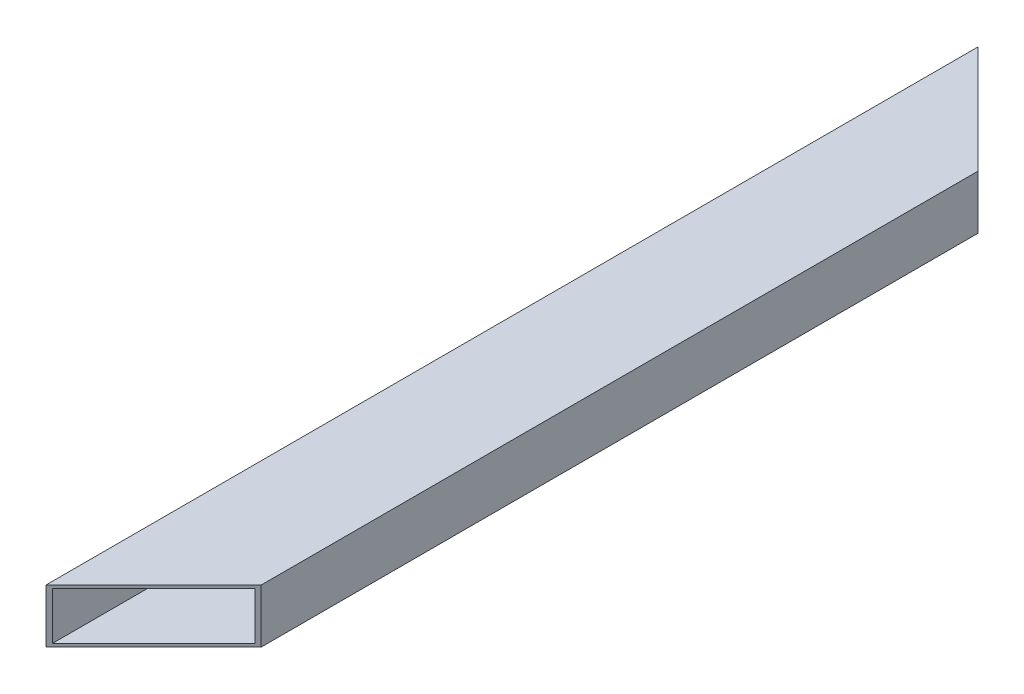
ISO-10303-21;
HEADER;
FILE_DESCRIPTION(('STEP AP214'),'2;1');
FILE_NAME('part.step','',(''),(''),'','','');
FILE_SCHEMA(('AUTOMOTIVE_DESIGN { 1 0 10303 214 1 1 1 1 }'));
ENDSEC;
DATA;
#1=APPLICATION_CONTEXT('core data for automotive mechanical design processes');
#2=APPLICATION_PROTOCOL_DEFINITION('international standard','automotive_design',2000,#1);
#3=PRODUCT_CONTEXT('',#1,'mechanical');
#4=PRODUCT('Part','Part','',(#3));
#5=PRODUCT_RELATED_PRODUCT_CATEGORY('part','',(#4));
#6=PRODUCT_DEFINITION_FORMATION('','',#4);
#7=PRODUCT_DEFINITION_CONTEXT('part definition',#1,'design');
#8=PRODUCT_DEFINITION('design','',#6,#7);
#9=PRODUCT_DEFINITION_SHAPE('','',#8);
#10=(LENGTH_UNIT() NAMED_UNIT(*) SI_UNIT(.MILLI.,.METRE.));
#11=(NAMED_UNIT(*) PLANE_ANGLE_UNIT() SI_UNIT($,.RADIAN.));
#12=(NAMED_UNIT(*) SI_UNIT($,.STERADIAN.) SOLID_ANGLE_UNIT());
#13=UNCERTAINTY_MEASURE_WITH_UNIT(LENGTH_MEASURE(1.E-05),#10,'distance_accuracy_value','');
#14=(GEOMETRIC_REPRESENTATION_CONTEXT(3) GLOBAL_UNCERTAINTY_ASSIGNED_CONTEXT((#13)) GLOBAL_UNIT_ASSIGNED_CONTEXT((#10,
#11,#12)) REPRESENTATION_CONTEXT('',''));
#15=CARTESIAN_POINT('',(0.,0.,0.));
#16=DIRECTION('',(0.,0.,1.));
#17=DIRECTION('',(1.,0.,0.));
#18=AXIS2_PLACEMENT_3D('',#15,#16,#17);
#19=CARTESIAN_POINT('',(25.4,-12.7,440.));
#20=DIRECTION('',(-1.,0.,0.));
#21=DIRECTION('',(0.,0.,1.));
#22=AXIS2_PLACEMENT_3D('',#19,#20,#21);
#23=PLANE('',#22);
#24=DIRECTION('',(0.,0.,-1.));
#25=VECTOR('',#24,1.);
#26=CARTESIAN_POINT('',(25.4,12.7,440.));
#27=LINE('',#26,#25);
#28=CARTESIAN_POINT('',(25.4,12.7,389.200000000001));
#29=VERTEX_POINT('',#28);
#30=CARTESIAN_POINT('',(25.4,12.7,50.7999999999994));
#31=VERTEX_POINT('',#30);
#32=EDGE_CURVE('E114',#29,#31,#27,.T.);
#33=ORIENTED_EDGE('',*,*,#32,.F.);
#34=DIRECTION('',(0.,1.,0.));
#35=VECTOR('',#34,1.);
#36=CARTESIAN_POINT('',(25.4,-13.3,389.200000000001));
#37=LINE('',#36,#35);
#38=CARTESIAN_POINT('',(25.4,-12.7,389.200000000001));
#39=VERTEX_POINT('',#38);
#40=EDGE_CURVE('E102',#39,#29,#37,.T.);
#41=ORIENTED_EDGE('',*,*,#40,.F.);
#42=DIRECTION('',(0.,0.,-1.));
#43=VECTOR('',#42,1.);
#44=CARTESIAN_POINT('',(25.4,-12.7,440.));
#45=LINE('',#44,#43);
#46=CARTESIAN_POINT('',(25.4,-12.7,50.7999999999996));
#47=VERTEX_POINT('',#46);
#48=EDGE_CURVE('E53',#39,#47,#45,.T.);
#49=ORIENTED_EDGE('',*,*,#48,.T.);
#50=DIRECTION('',(0.,1.,0.));
#51=VECTOR('',#50,1.);
#52=CARTESIAN_POINT('',(25.4,-13.3,50.7999999999994));
#53=LINE('',#52,#51);
#54=EDGE_CURVE('E168',#47,#31,#53,.T.);
#55=ORIENTED_EDGE('',*,*,#54,.T.);
#56=EDGE_LOOP('',(#33,#41,#49,#55));
#57=FACE_BOUND('',#56,.T.);
#58=ADVANCED_FACE('F32',(#57),#23,.F.);
#59=CARTESIAN_POINT('',(-25.4000000000001,12.7,440.));
#60=DIRECTION('',(0.,-1.,0.));
#61=DIRECTION('',(0.,0.,-1.));
#62=AXIS2_PLACEMENT_3D('',#59,#60,#61);
#63=PLANE('',#62);
#64=DIRECTION('',(0.,0.,-1.));
#65=VECTOR('',#64,1.);
#66=CARTESIAN_POINT('',(-25.4000000000001,12.7,440.));
#67=LINE('',#66,#65);
#68=CARTESIAN_POINT('',(-25.4,12.7,440.));
#69=VERTEX_POINT('',#68);
#70=CARTESIAN_POINT('',(-25.4,12.7,0.));
#71=VERTEX_POINT('',#70);
#72=EDGE_CURVE('E108',#69,#71,#67,.T.);
#73=ORIENTED_EDGE('',*,*,#72,.F.);
#74=DIRECTION('',(-0.707106781186551,0.,0.707106781186543));
#75=VECTOR('',#74,1.);
#76=CARTESIAN_POINT('',(-25.4,12.7,440.));
#77=LINE('',#76,#75);
#78=EDGE_CURVE('E96',#29,#69,#77,.T.);
#79=ORIENTED_EDGE('',*,*,#78,.F.);
#80=ORIENTED_EDGE('',*,*,#32,.T.);
#81=DIRECTION('',(0.707106781186551,0.,0.707106781186544));
#82=VECTOR('',#81,1.);
#83=CARTESIAN_POINT('',(-25.4,12.7,0.));
#84=LINE('',#83,#82);
#85=EDGE_CURVE('E111',#71,#31,#84,.T.);
#86=ORIENTED_EDGE('',*,*,#85,.F.);
#87=EDGE_LOOP('',(#73,#79,#80,#86));
#88=FACE_BOUND('',#87,.T.);
#89=ADVANCED_FACE('F109',(#88),#63,.F.);
#90=CARTESIAN_POINT('',(-25.4000000000001,-12.7,440.));
#91=DIRECTION('',(1.,0.,0.));
#92=DIRECTION('',(0.,0.,-1.));
#93=AXIS2_PLACEMENT_3D('',#90,#91,#92);
#94=PLANE('',#93);
#95=DIRECTION('',(0.,-1.,0.));
#96=VECTOR('',#95,1.);
#97=CARTESIAN_POINT('',(-25.4,-12.7,0.));
#98=LINE('',#97,#96);
#99=CARTESIAN_POINT('',(-25.4,-12.7,0.));
#100=VERTEX_POINT('',#99);
#101=EDGE_CURVE('E120',#71,#100,#98,.T.);
#102=ORIENTED_EDGE('',*,*,#101,.T.);
#103=DIRECTION('',(0.,0.,-1.));
#104=VECTOR('',#103,1.);
#105=CARTESIAN_POINT('',(-25.4000000000001,-12.7,440.));
#106=LINE('',#105,#104);
#107=CARTESIAN_POINT('',(-25.4000000000001,-12.7,440.));
#108=VERTEX_POINT('',#107);
#109=EDGE_CURVE('E115',#108,#100,#106,.T.);
#110=ORIENTED_EDGE('',*,*,#109,.F.);
#111=DIRECTION('',(0.,-1.,0.));
#112=VECTOR('',#111,1.);
#113=CARTESIAN_POINT('',(-25.4000000000001,-12.7,440.));
#114=LINE('',#113,#112);
#115=EDGE_CURVE('E100',#69,#108,#114,.T.);
#116=ORIENTED_EDGE('',*,*,#115,.F.);
#117=ORIENTED_EDGE('',*,*,#72,.T.);
#118=EDGE_LOOP('',(#102,#110,#116,#117));
#119=FACE_BOUND('',#118,.T.);
#120=ADVANCED_FACE('F118',(#119),#94,.F.);
#121=CARTESIAN_POINT('',(-25.4000000000001,-12.7,440.));
#122=DIRECTION('',(0.,1.,0.));
#123=DIRECTION('',(0.,0.,1.));
#124=AXIS2_PLACEMENT_3D('',#121,#122,#123);
#125=PLANE('',#124);
#126=ORIENTED_EDGE('',*,*,#48,.F.);
#127=DIRECTION('',(-0.707106781186552,0.,0.707106781186543));
#128=VECTOR('',#127,1.);
#129=CARTESIAN_POINT('',(-25.4,-12.7,440.));
#130=LINE('',#129,#128);
#131=EDGE_CURVE('E172',#39,#108,#130,.T.);
#132=ORIENTED_EDGE('',*,*,#131,.T.);
#133=ORIENTED_EDGE('',*,*,#109,.T.);
#134=DIRECTION('',(0.707106781186551,0.,0.707106781186544));
#135=VECTOR('',#134,1.);
#136=CARTESIAN_POINT('',(194.6,-12.7,219.999999999998));
#137=LINE('',#136,#135);
#138=EDGE_CURVE('E149',#100,#47,#137,.T.);
#139=ORIENTED_EDGE('',*,*,#138,.T.);
#140=EDGE_LOOP('',(#126,#132,#133,#139));
#141=FACE_BOUND('',#140,.T.);
#142=ADVANCED_FACE('F192',(#141),#125,.F.);
#143=CARTESIAN_POINT('',(-23.9,-11.2,440.));
#144=DIRECTION('',(0.,1.,0.));
#145=DIRECTION('',(0.,0.,1.));
#146=AXIS2_PLACEMENT_3D('',#143,#144,#145);
#147=PLANE('',#146);
#148=DIRECTION('',(-0.707106781186552,0.,0.707106781186543));
#149=VECTOR('',#148,1.);
#150=CARTESIAN_POINT('',(-24.6499999999999,-11.2,439.25));
#151=LINE('',#150,#149);
#152=CARTESIAN_POINT('',(23.9,-11.2,390.700000000001));
#153=VERTEX_POINT('',#152);
#154=CARTESIAN_POINT('',(-23.9,-11.2,438.5));
#155=VERTEX_POINT('',#154);
#156=EDGE_CURVE('E45',#153,#155,#151,.T.);
#157=ORIENTED_EDGE('',*,*,#156,.F.);
#158=DIRECTION('',(0.,0.,-1.));
#159=VECTOR('',#158,1.);
#160=CARTESIAN_POINT('',(23.8999999999999,-11.2,440.));
#161=LINE('',#160,#159);
#162=CARTESIAN_POINT('',(23.8999999999999,-11.2,49.2999999999995));
#163=VERTEX_POINT('',#162);
#164=EDGE_CURVE('E123',#153,#163,#161,.T.);
#165=ORIENTED_EDGE('',*,*,#164,.T.);
#166=DIRECTION('',(0.707106781186551,0.,0.707106781186544));
#167=VECTOR('',#166,1.);
#168=CARTESIAN_POINT('',(195.35,-11.2,220.749999999998));
#169=LINE('',#168,#167);
#170=CARTESIAN_POINT('',(-23.9,-11.2,1.5));
#171=VERTEX_POINT('',#170);
#172=EDGE_CURVE('E138',#171,#163,#169,.T.);
#173=ORIENTED_EDGE('',*,*,#172,.F.);
#174=DIRECTION('',(0.,0.,-1.));
#175=VECTOR('',#174,1.);
#176=CARTESIAN_POINT('',(-23.9,-11.2,440.));
#177=LINE('',#176,#175);
#178=EDGE_CURVE('E147',#155,#171,#177,.T.);
#179=ORIENTED_EDGE('',*,*,#178,.F.);
#180=EDGE_LOOP('',(#157,#165,#173,#179));
#181=FACE_BOUND('',#180,.T.);
#182=ADVANCED_FACE('F146',(#181),#147,.T.);
#183=CARTESIAN_POINT('',(23.8999999999999,-11.2,440.));
#184=DIRECTION('',(-1.,0.,0.));
#185=DIRECTION('',(0.,0.,1.));
#186=AXIS2_PLACEMENT_3D('',#183,#184,#185);
#187=PLANE('',#186);
#188=DIRECTION('',(0.,-1.,0.));
#189=VECTOR('',#188,1.);
#190=CARTESIAN_POINT('',(23.9,-11.2,390.700000000001));
#191=LINE('',#190,#189);
#192=CARTESIAN_POINT('',(23.9,11.2,390.700000000001));
#193=VERTEX_POINT('',#192);
#194=EDGE_CURVE('E164',#193,#153,#191,.T.);
#195=ORIENTED_EDGE('',*,*,#194,.F.);
#196=DIRECTION('',(0.,0.,-1.));
#197=VECTOR('',#196,1.);
#198=CARTESIAN_POINT('',(23.8999999999999,11.2,440.));
#199=LINE('',#198,#197);
#200=CARTESIAN_POINT('',(23.8999999999999,11.2,49.2999999999995));
#201=VERTEX_POINT('',#200);
#202=EDGE_CURVE('E159',#193,#201,#199,.T.);
#203=ORIENTED_EDGE('',*,*,#202,.T.);
#204=DIRECTION('',(0.,1.,0.));
#205=VECTOR('',#204,1.);
#206=CARTESIAN_POINT('',(23.8999999999999,-11.2,49.2999999999995));
#207=LINE('',#206,#205);
#208=EDGE_CURVE('E150',#163,#201,#207,.T.);
#209=ORIENTED_EDGE('',*,*,#208,.F.);
#210=ORIENTED_EDGE('',*,*,#164,.F.);
#211=EDGE_LOOP('',(#195,#203,#209,#210));
#212=FACE_BOUND('',#211,.T.);
#213=ADVANCED_FACE('F163',(#212),#187,.T.);
#214=CARTESIAN_POINT('',(-23.9,11.2,440.));
#215=DIRECTION('',(0.,-1.,0.));
#216=DIRECTION('',(1.,0.,0.));
#217=AXIS2_PLACEMENT_3D('',#214,#215,#216);
#218=PLANE('',#217);
#219=DIRECTION('',(0.707106781186552,0.,-0.707106781186543));
#220=VECTOR('',#219,1.);
#221=CARTESIAN_POINT('',(-24.6499999999999,11.2,439.25));
#222=LINE('',#221,#220);
#223=CARTESIAN_POINT('',(-23.9,11.2,438.5));
#224=VERTEX_POINT('',#223);
#225=EDGE_CURVE('E176',#224,#193,#222,.T.);
#226=ORIENTED_EDGE('',*,*,#225,.F.);
#227=DIRECTION('',(0.,0.,-1.));
#228=VECTOR('',#227,1.);
#229=CARTESIAN_POINT('',(-23.9,11.2,440.));
#230=LINE('',#229,#228);
#231=CARTESIAN_POINT('',(-23.9,11.2,1.5));
#232=VERTEX_POINT('',#231);
#233=EDGE_CURVE('E158',#224,#232,#230,.T.);
#234=ORIENTED_EDGE('',*,*,#233,.T.);
#235=DIRECTION('',(-0.707106781186551,0.,-0.707106781186544));
#236=VECTOR('',#235,1.);
#237=CARTESIAN_POINT('',(195.35,11.2,220.749999999998));
#238=LINE('',#237,#236);
#239=EDGE_CURVE('E141',#201,#232,#238,.T.);
#240=ORIENTED_EDGE('',*,*,#239,.F.);
#241=ORIENTED_EDGE('',*,*,#202,.F.);
#242=EDGE_LOOP('',(#226,#234,#240,#241));
#243=FACE_BOUND('',#242,.T.);
#244=ADVANCED_FACE('F167',(#243),#218,.T.);
#245=CARTESIAN_POINT('',(-23.9,-11.2,440.));
#246=DIRECTION('',(1.,0.,0.));
#247=DIRECTION('',(0.,0.,-1.));
#248=AXIS2_PLACEMENT_3D('',#245,#246,#247);
#249=PLANE('',#248);
#250=DIRECTION('',(0.,1.,0.));
#251=VECTOR('',#250,1.);
#252=CARTESIAN_POINT('',(-23.9,-11.2,438.5));
#253=LINE('',#252,#251);
#254=EDGE_CURVE('E11',#155,#224,#253,.T.);
#255=ORIENTED_EDGE('',*,*,#254,.F.);
#256=ORIENTED_EDGE('',*,*,#178,.T.);
#257=DIRECTION('',(0.,-1.,0.));
#258=VECTOR('',#257,1.);
#259=CARTESIAN_POINT('',(-23.9,-11.2,1.5));
#260=LINE('',#259,#258);
#261=EDGE_CURVE('E39',#232,#171,#260,.T.);
#262=ORIENTED_EDGE('',*,*,#261,.F.);
#263=ORIENTED_EDGE('',*,*,#233,.F.);
#264=EDGE_LOOP('',(#255,#256,#262,#263));
#265=FACE_BOUND('',#264,.T.);
#266=ADVANCED_FACE('F178',(#265),#249,.T.);
#267=CARTESIAN_POINT('',(-25.4,-13.3,0.));
#268=DIRECTION('',(-0.707106781186544,0.,0.707106781186551));
#269=DIRECTION('',(0.707106781186551,0.,0.707106781186544));
#270=AXIS2_PLACEMENT_3D('',#267,#268,#269);
#271=PLANE('',#270);
#272=ORIENTED_EDGE('',*,*,#172,.T.);
#273=ORIENTED_EDGE('',*,*,#208,.T.);
#274=ORIENTED_EDGE('',*,*,#239,.T.);
#275=ORIENTED_EDGE('',*,*,#261,.T.);
#276=EDGE_LOOP('',(#272,#273,#274,#275));
#277=FACE_BOUND('',#276,.T.);
#278=ORIENTED_EDGE('',*,*,#101,.F.);
#279=ORIENTED_EDGE('',*,*,#85,.T.);
#280=ORIENTED_EDGE('',*,*,#54,.F.);
#281=ORIENTED_EDGE('',*,*,#138,.F.);
#282=EDGE_LOOP('',(#278,#279,#280,#281));
#283=FACE_BOUND('',#282,.T.);
#284=ADVANCED_FACE('F135',(#277,#283),#271,.F.);
#285=CARTESIAN_POINT('',(-25.4,-13.3,440.));
#286=DIRECTION('',(-0.707106781186543,0.,-0.707106781186552));
#287=DIRECTION('',(-0.707106781186552,0.,0.707106781186543));
#288=AXIS2_PLACEMENT_3D('',#285,#286,#287);
#289=PLANE('',#288);
#290=ORIENTED_EDGE('',*,*,#156,.T.);
#291=ORIENTED_EDGE('',*,*,#254,.T.);
#292=ORIENTED_EDGE('',*,*,#225,.T.);
#293=ORIENTED_EDGE('',*,*,#194,.T.);
#294=EDGE_LOOP('',(#290,#291,#292,#293));
#295=FACE_BOUND('',#294,.T.);
#296=ORIENTED_EDGE('',*,*,#40,.T.);
#297=ORIENTED_EDGE('',*,*,#78,.T.);
#298=ORIENTED_EDGE('',*,*,#115,.T.);
#299=ORIENTED_EDGE('',*,*,#131,.F.);
#300=EDGE_LOOP('',(#296,#297,#298,#299));
#301=FACE_BOUND('',#300,.T.);
#302=ADVANCED_FACE('F98',(#295,#301),#289,.F.);
#303=CLOSED_SHELL('',(#58,#89,#120,#142,#182,#213,#244,#266,#284,#302));
#304=MANIFOLD_SOLID_BREP('B2',#303);
#305=ADVANCED_BREP_SHAPE_REPRESENTATION('',(#18,#304),#14);
#306=SHAPE_DEFINITION_REPRESENTATION(#9,#305);
ENDSEC;
END-ISO-10303-21;
